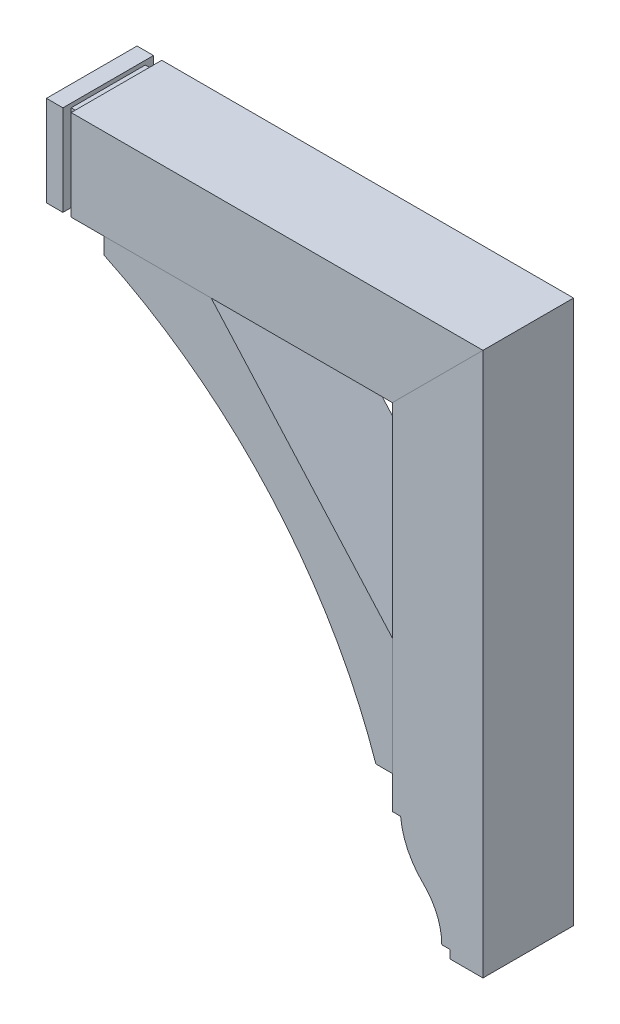
ISO-10303-21;
HEADER;
FILE_DESCRIPTION(('STEP AP214'),'2;1');
FILE_NAME('part.step','',(''),(''),'','','');
FILE_SCHEMA(('AUTOMOTIVE_DESIGN { 1 0 10303 214 1 1 1 1 }'));
ENDSEC;
DATA;
#1=APPLICATION_CONTEXT('core data for automotive mechanical design processes');
#2=APPLICATION_PROTOCOL_DEFINITION('international standard','automotive_design',2000,#1);
#3=PRODUCT_CONTEXT('',#1,'mechanical');
#4=PRODUCT('Part','Part','',(#3));
#5=PRODUCT_RELATED_PRODUCT_CATEGORY('part','',(#4));
#6=PRODUCT_DEFINITION_FORMATION('','',#4);
#7=PRODUCT_DEFINITION_CONTEXT('part definition',#1,'design');
#8=PRODUCT_DEFINITION('design','',#6,#7);
#9=PRODUCT_DEFINITION_SHAPE('','',#8);
#10=(LENGTH_UNIT() NAMED_UNIT(*) SI_UNIT(.MILLI.,.METRE.));
#11=(NAMED_UNIT(*) PLANE_ANGLE_UNIT() SI_UNIT($,.RADIAN.));
#12=(NAMED_UNIT(*) SI_UNIT($,.STERADIAN.) SOLID_ANGLE_UNIT());
#13=UNCERTAINTY_MEASURE_WITH_UNIT(LENGTH_MEASURE(1.E-05),#10,'distance_accuracy_value','');
#14=(GEOMETRIC_REPRESENTATION_CONTEXT(3) GLOBAL_UNCERTAINTY_ASSIGNED_CONTEXT((#13)) GLOBAL_UNIT_ASSIGNED_CONTEXT((#10,
#11,#12)) REPRESENTATION_CONTEXT('',''));
#15=CARTESIAN_POINT('',(0.,0.,0.));
#16=DIRECTION('',(0.,0.,1.));
#17=DIRECTION('',(1.,0.,0.));
#18=AXIS2_PLACEMENT_3D('',#15,#16,#17);
#19=CARTESIAN_POINT('',(0.,228.24431630972,69.85));
#20=DIRECTION('',(0.,1.,0.));
#21=DIRECTION('',(-1.,0.,0.));
#22=AXIS2_PLACEMENT_3D('',#19,#20,#21);
#23=PLANE('',#22);
#24=DIRECTION('',(1.,0.,0.));
#25=VECTOR('',#24,1.);
#26=CARTESIAN_POINT('',(0.,228.24431630972,-69.85));
#27=LINE('',#26,#25);
#28=CARTESIAN_POINT('',(-352.423927863135,228.24431630972,-69.85));
#29=VERTEX_POINT('',#28);
#30=CARTESIAN_POINT('',(142.876072136865,228.24431630972,-69.85));
#31=VERTEX_POINT('',#30);
#32=EDGE_CURVE('E131',#29,#31,#27,.T.);
#33=ORIENTED_EDGE('',*,*,#32,.T.);
#34=DIRECTION('',(0.,0.,-1.));
#35=VECTOR('',#34,1.);
#36=CARTESIAN_POINT('',(142.876072136865,228.24431630972,69.85));
#37=LINE('',#36,#35);
#38=CARTESIAN_POINT('',(142.876072136865,228.24431630972,69.85));
#39=VERTEX_POINT('',#38);
#40=EDGE_CURVE('E13',#39,#31,#37,.T.);
#41=ORIENTED_EDGE('',*,*,#40,.F.);
#42=DIRECTION('',(1.,0.,0.));
#43=VECTOR('',#42,1.);
#44=CARTESIAN_POINT('',(0.,228.24431630972,69.85));
#45=LINE('',#44,#43);
#46=CARTESIAN_POINT('',(-352.423927863135,228.24431630972,69.85));
#47=VERTEX_POINT('',#46);
#48=EDGE_CURVE('E114',#47,#39,#45,.T.);
#49=ORIENTED_EDGE('',*,*,#48,.F.);
#50=DIRECTION('',(0.,0.,-1.));
#51=VECTOR('',#50,1.);
#52=CARTESIAN_POINT('',(-352.423927863135,228.24431630972,69.85));
#53=LINE('',#52,#51);
#54=EDGE_CURVE('E127',#47,#29,#53,.T.);
#55=ORIENTED_EDGE('',*,*,#54,.T.);
#56=EDGE_LOOP('',(#33,#41,#49,#55));
#57=FACE_BOUND('',#56,.T.);
#58=ADVANCED_FACE('F62',(#57),#23,.F.);
#59=CARTESIAN_POINT('',(-42.6841220864275,42.6841220864275,69.85));
#60=DIRECTION('',(-0.707106781186548,0.707106781186547,0.));
#61=DIRECTION('',(-0.707106781186547,-0.707106781186548,0.));
#62=AXIS2_PLACEMENT_3D('',#59,#60,#61);
#63=PLANE('',#62);
#64=DIRECTION('',(0.707106781186547,0.707106781186548,0.));
#65=VECTOR('',#64,1.);
#66=CARTESIAN_POINT('',(-42.6841220864275,42.6841220864275,-69.85));
#67=LINE('',#66,#65);
#68=CARTESIAN_POINT('',(282.576072136865,367.94431630972,-69.85));
#69=VERTEX_POINT('',#68);
#70=EDGE_CURVE('E119',#31,#69,#67,.T.);
#71=ORIENTED_EDGE('',*,*,#70,.T.);
#72=DIRECTION('',(0.,0.,-1.));
#73=VECTOR('',#72,1.);
#74=CARTESIAN_POINT('',(282.576072136865,367.94431630972,69.85));
#75=LINE('',#74,#73);
#76=CARTESIAN_POINT('',(282.576072136865,367.94431630972,69.85));
#77=VERTEX_POINT('',#76);
#78=EDGE_CURVE('E71',#77,#69,#75,.T.);
#79=ORIENTED_EDGE('',*,*,#78,.F.);
#80=DIRECTION('',(0.707106781186547,0.707106781186548,0.));
#81=VECTOR('',#80,1.);
#82=CARTESIAN_POINT('',(-42.6841220864275,42.6841220864275,69.85));
#83=LINE('',#82,#81);
#84=EDGE_CURVE('E109',#39,#77,#83,.T.);
#85=ORIENTED_EDGE('',*,*,#84,.F.);
#86=ORIENTED_EDGE('',*,*,#40,.T.);
#87=EDGE_LOOP('',(#71,#79,#85,#86));
#88=FACE_BOUND('',#87,.T.);
#89=ADVANCED_FACE('F118',(#88),#63,.F.);
#90=CARTESIAN_POINT('',(0.,367.94431630972,69.85));
#91=DIRECTION('',(0.,-1.,0.));
#92=DIRECTION('',(1.,0.,0.));
#93=AXIS2_PLACEMENT_3D('',#90,#91,#92);
#94=PLANE('',#93);
#95=DIRECTION('',(-1.,0.,0.));
#96=VECTOR('',#95,1.);
#97=CARTESIAN_POINT('',(0.,367.94431630972,-69.85));
#98=LINE('',#97,#96);
#99=CARTESIAN_POINT('',(-352.423927863135,367.94431630972,-69.85));
#100=VERTEX_POINT('',#99);
#101=EDGE_CURVE('E96',#69,#100,#98,.T.);
#102=ORIENTED_EDGE('',*,*,#101,.T.);
#103=DIRECTION('',(0.,0.,-1.));
#104=VECTOR('',#103,1.);
#105=CARTESIAN_POINT('',(-352.423927863135,367.94431630972,69.85));
#106=LINE('',#105,#104);
#107=CARTESIAN_POINT('',(-352.423927863135,367.94431630972,69.85));
#108=VERTEX_POINT('',#107);
#109=EDGE_CURVE('E121',#108,#100,#106,.T.);
#110=ORIENTED_EDGE('',*,*,#109,.F.);
#111=DIRECTION('',(-1.,0.,0.));
#112=VECTOR('',#111,1.);
#113=CARTESIAN_POINT('',(0.,367.94431630972,69.85));
#114=LINE('',#113,#112);
#115=EDGE_CURVE('E112',#77,#108,#114,.T.);
#116=ORIENTED_EDGE('',*,*,#115,.F.);
#117=ORIENTED_EDGE('',*,*,#78,.T.);
#118=EDGE_LOOP('',(#102,#110,#116,#117));
#119=FACE_BOUND('',#118,.T.);
#120=ADVANCED_FACE('F122',(#119),#94,.F.);
#121=CARTESIAN_POINT('',(-352.423927863135,0.,69.85));
#122=DIRECTION('',(1.,0.,0.));
#123=DIRECTION('',(0.,0.,-1.));
#124=AXIS2_PLACEMENT_3D('',#121,#122,#123);
#125=PLANE('',#124);
#126=DIRECTION('',(0.,-1.,0.));
#127=VECTOR('',#126,1.);
#128=CARTESIAN_POINT('',(-352.423927863135,0.,-69.85));
#129=LINE('',#128,#127);
#130=EDGE_CURVE('E102',#100,#29,#129,.T.);
#131=ORIENTED_EDGE('',*,*,#130,.T.);
#132=ORIENTED_EDGE('',*,*,#54,.F.);
#133=DIRECTION('',(0.,-1.,0.));
#134=VECTOR('',#133,1.);
#135=CARTESIAN_POINT('',(-352.423927863135,0.,69.85));
#136=LINE('',#135,#134);
#137=EDGE_CURVE('E79',#108,#47,#136,.T.);
#138=ORIENTED_EDGE('',*,*,#137,.F.);
#139=ORIENTED_EDGE('',*,*,#109,.T.);
#140=EDGE_LOOP('',(#131,#132,#138,#139));
#141=FACE_BOUND('',#140,.T.);
#142=ADVANCED_FACE('F143',(#141),#125,.F.);
#143=CARTESIAN_POINT('',(0.,0.,69.85));
#144=DIRECTION('',(0.,0.,1.));
#145=DIRECTION('',(1.,0.,0.));
#146=AXIS2_PLACEMENT_3D('',#143,#144,#145);
#147=PLANE('',#146);
#148=ORIENTED_EDGE('',*,*,#48,.T.);
#149=ORIENTED_EDGE('',*,*,#84,.T.);
#150=ORIENTED_EDGE('',*,*,#115,.T.);
#151=ORIENTED_EDGE('',*,*,#137,.T.);
#152=EDGE_LOOP('',(#148,#149,#150,#151));
#153=FACE_BOUND('',#152,.T.);
#154=ADVANCED_FACE('F110',(#153),#147,.T.);
#155=CARTESIAN_POINT('',(0.,0.,-69.85));
#156=DIRECTION('',(0.,0.,1.));
#157=DIRECTION('',(1.,0.,0.));
#158=AXIS2_PLACEMENT_3D('',#155,#156,#157);
#159=PLANE('',#158);
#160=ORIENTED_EDGE('',*,*,#32,.F.);
#161=ORIENTED_EDGE('',*,*,#130,.F.);
#162=ORIENTED_EDGE('',*,*,#101,.F.);
#163=ORIENTED_EDGE('',*,*,#70,.F.);
#164=EDGE_LOOP('',(#160,#161,#162,#163));
#165=FACE_BOUND('',#164,.T.);
#166=ADVANCED_FACE('F146',(#165),#159,.F.);
#167=CLOSED_SHELL('',(#58,#89,#120,#142,#154,#166));
#168=MANIFOLD_SOLID_BREP('B2',#167);
#169=CARTESIAN_POINT('',(0.,361.59431630972,57.15));
#170=DIRECTION('',(0.,-1.,0.));
#171=DIRECTION('',(0.,0.,-1.));
#172=AXIS2_PLACEMENT_3D('',#169,#170,#171);
#173=PLANE('',#172);
#174=DIRECTION('',(-1.,0.,0.));
#175=VECTOR('',#174,1.);
#176=CARTESIAN_POINT('',(0.,361.59431630972,-57.15));
#177=LINE('',#176,#175);
#178=CARTESIAN_POINT('',(-352.423927863135,361.59431630972,-57.15));
#179=VERTEX_POINT('',#178);
#180=CARTESIAN_POINT('',(-365.123927863135,361.59431630972,-57.15));
#181=VERTEX_POINT('',#180);
#182=EDGE_CURVE('E357',#179,#181,#177,.T.);
#183=ORIENTED_EDGE('',*,*,#182,.T.);
#184=DIRECTION('',(0.,0.,-1.));
#185=VECTOR('',#184,1.);
#186=CARTESIAN_POINT('',(-365.123927863135,361.59431630972,57.15));
#187=LINE('',#186,#185);
#188=CARTESIAN_POINT('',(-365.123927863135,361.59431630972,57.15));
#189=VERTEX_POINT('',#188);
#190=EDGE_CURVE('E60',#189,#181,#187,.T.);
#191=ORIENTED_EDGE('',*,*,#190,.F.);
#192=DIRECTION('',(-1.,0.,0.));
#193=VECTOR('',#192,1.);
#194=CARTESIAN_POINT('',(0.,361.59431630972,57.15));
#195=LINE('',#194,#193);
#196=CARTESIAN_POINT('',(-352.423927863135,361.59431630972,57.15));
#197=VERTEX_POINT('',#196);
#198=EDGE_CURVE('E307',#197,#189,#195,.T.);
#199=ORIENTED_EDGE('',*,*,#198,.F.);
#200=DIRECTION('',(0.,0.,-1.));
#201=VECTOR('',#200,1.);
#202=CARTESIAN_POINT('',(-352.423927863135,361.59431630972,57.15));
#203=LINE('',#202,#201);
#204=EDGE_CURVE('E248',#197,#179,#203,.T.);
#205=ORIENTED_EDGE('',*,*,#204,.T.);
#206=EDGE_LOOP('',(#183,#191,#199,#205));
#207=FACE_BOUND('',#206,.T.);
#208=ADVANCED_FACE('F229',(#207),#173,.F.);
#209=CARTESIAN_POINT('',(0.,234.59431630972,57.15));
#210=DIRECTION('',(0.,-1.,0.));
#211=DIRECTION('',(0.,0.,-1.));
#212=AXIS2_PLACEMENT_3D('',#209,#210,#211);
#213=PLANE('',#212);
#214=DIRECTION('',(-1.,0.,0.));
#215=VECTOR('',#214,1.);
#216=CARTESIAN_POINT('',(0.,234.59431630972,-57.15));
#217=LINE('',#216,#215);
#218=CARTESIAN_POINT('',(-352.423927863135,234.59431630972,-57.15));
#219=VERTEX_POINT('',#218);
#220=CARTESIAN_POINT('',(-365.123927863135,234.59431630972,-57.15));
#221=VERTEX_POINT('',#220);
#222=EDGE_CURVE('E365',#219,#221,#217,.T.);
#223=ORIENTED_EDGE('',*,*,#222,.F.);
#224=DIRECTION('',(0.,0.,-1.));
#225=VECTOR('',#224,1.);
#226=CARTESIAN_POINT('',(-352.423927863135,234.59431630972,57.15));
#227=LINE('',#226,#225);
#228=CARTESIAN_POINT('',(-352.423927863135,234.59431630972,57.15));
#229=VERTEX_POINT('',#228);
#230=EDGE_CURVE('E317',#229,#219,#227,.T.);
#231=ORIENTED_EDGE('',*,*,#230,.F.);
#232=DIRECTION('',(-1.,0.,0.));
#233=VECTOR('',#232,1.);
#234=CARTESIAN_POINT('',(0.,234.59431630972,57.15));
#235=LINE('',#234,#233);
#236=CARTESIAN_POINT('',(-365.123927863135,234.59431630972,57.15));
#237=VERTEX_POINT('',#236);
#238=EDGE_CURVE('E306',#229,#237,#235,.T.);
#239=ORIENTED_EDGE('',*,*,#238,.T.);
#240=DIRECTION('',(0.,0.,-1.));
#241=VECTOR('',#240,1.);
#242=CARTESIAN_POINT('',(-365.123927863135,234.59431630972,57.15));
#243=LINE('',#242,#241);
#244=EDGE_CURVE('E239',#237,#221,#243,.T.);
#245=ORIENTED_EDGE('',*,*,#244,.T.);
#246=EDGE_LOOP('',(#223,#231,#239,#245));
#247=FACE_BOUND('',#246,.T.);
#248=ADVANCED_FACE('F315',(#247),#213,.T.);
#249=CARTESIAN_POINT('',(-352.423927863135,0.,57.15));
#250=DIRECTION('',(1.,0.,0.));
#251=DIRECTION('',(0.,0.,-1.));
#252=AXIS2_PLACEMENT_3D('',#249,#250,#251);
#253=PLANE('',#252);
#254=DIRECTION('',(0.,-1.,0.));
#255=VECTOR('',#254,1.);
#256=CARTESIAN_POINT('',(-352.423927863135,0.,-57.15));
#257=LINE('',#256,#255);
#258=EDGE_CURVE('E367',#179,#219,#257,.T.);
#259=ORIENTED_EDGE('',*,*,#258,.F.);
#260=ORIENTED_EDGE('',*,*,#204,.F.);
#261=DIRECTION('',(0.,-1.,0.));
#262=VECTOR('',#261,1.);
#263=CARTESIAN_POINT('',(-352.423927863135,0.,57.15));
#264=LINE('',#263,#262);
#265=EDGE_CURVE('E319',#197,#229,#264,.T.);
#266=ORIENTED_EDGE('',*,*,#265,.T.);
#267=ORIENTED_EDGE('',*,*,#230,.T.);
#268=EDGE_LOOP('',(#259,#260,#266,#267));
#269=FACE_BOUND('',#268,.T.);
#270=ADVANCED_FACE('F443',(#269),#253,.T.);
#271=CARTESIAN_POINT('',(0.,0.,57.15));
#272=DIRECTION('',(0.,0.,1.));
#273=DIRECTION('',(1.,0.,0.));
#274=AXIS2_PLACEMENT_3D('',#271,#272,#273);
#275=PLANE('',#274);
#276=ORIENTED_EDGE('',*,*,#198,.T.);
#277=DIRECTION('',(0.,-1.,0.));
#278=VECTOR('',#277,1.);
#279=CARTESIAN_POINT('',(-365.123927863135,0.,57.15));
#280=LINE('',#279,#278);
#281=EDGE_CURVE('E302',#189,#237,#280,.T.);
#282=ORIENTED_EDGE('',*,*,#281,.T.);
#283=ORIENTED_EDGE('',*,*,#238,.F.);
#284=ORIENTED_EDGE('',*,*,#265,.F.);
#285=EDGE_LOOP('',(#276,#282,#283,#284));
#286=FACE_BOUND('',#285,.T.);
#287=ADVANCED_FACE('F304',(#286),#275,.T.);
#288=CARTESIAN_POINT('',(0.,0.,-57.15));
#289=DIRECTION('',(0.,0.,1.));
#290=DIRECTION('',(1.,0.,0.));
#291=AXIS2_PLACEMENT_3D('',#288,#289,#290);
#292=PLANE('',#291);
#293=ORIENTED_EDGE('',*,*,#182,.F.);
#294=ORIENTED_EDGE('',*,*,#258,.T.);
#295=ORIENTED_EDGE('',*,*,#222,.T.);
#296=DIRECTION('',(0.,-1.,0.));
#297=VECTOR('',#296,1.);
#298=CARTESIAN_POINT('',(-365.123927863135,0.,-57.15));
#299=LINE('',#298,#297);
#300=EDGE_CURVE('E325',#181,#221,#299,.T.);
#301=ORIENTED_EDGE('',*,*,#300,.F.);
#302=EDGE_LOOP('',(#293,#294,#295,#301));
#303=FACE_BOUND('',#302,.T.);
#304=ADVANCED_FACE('F429',(#303),#292,.F.);
#305=CARTESIAN_POINT('',(0.,367.94431630972,69.85));
#306=DIRECTION('',(0.,-1.,0.));
#307=DIRECTION('',(0.,0.,-1.));
#308=AXIS2_PLACEMENT_3D('',#305,#306,#307);
#309=PLANE('',#308);
#310=DIRECTION('',(-1.,0.,0.));
#311=VECTOR('',#310,1.);
#312=CARTESIAN_POINT('',(0.,367.94431630972,-69.85));
#313=LINE('',#312,#311);
#314=CARTESIAN_POINT('',(-365.123927863135,367.94431630972,-69.85));
#315=VERTEX_POINT('',#314);
#316=CARTESIAN_POINT('',(-390.523927863135,367.94431630972,-69.85));
#317=VERTEX_POINT('',#316);
#318=EDGE_CURVE('E334',#315,#317,#313,.T.);
#319=ORIENTED_EDGE('',*,*,#318,.T.);
#320=DIRECTION('',(0.,0.,1.));
#321=VECTOR('',#320,1.);
#322=CARTESIAN_POINT('',(-390.523927863135,367.94431630972,0.));
#323=LINE('',#322,#321);
#324=CARTESIAN_POINT('',(-390.523927863135,367.94431630972,69.85));
#325=VERTEX_POINT('',#324);
#326=EDGE_CURVE('E354',#325,#317,#323,.F.);
#327=ORIENTED_EDGE('',*,*,#326,.F.);
#328=DIRECTION('',(-1.,0.,0.));
#329=VECTOR('',#328,1.);
#330=CARTESIAN_POINT('',(0.,367.94431630972,69.85));
#331=LINE('',#330,#329);
#332=CARTESIAN_POINT('',(-365.123927863135,367.94431630972,69.85));
#333=VERTEX_POINT('',#332);
#334=EDGE_CURVE('E339',#333,#325,#331,.T.);
#335=ORIENTED_EDGE('',*,*,#334,.F.);
#336=DIRECTION('',(0.,0.,-1.));
#337=VECTOR('',#336,1.);
#338=CARTESIAN_POINT('',(-365.123927863135,367.94431630972,69.85));
#339=LINE('',#338,#337);
#340=EDGE_CURVE('E362',#333,#315,#339,.T.);
#341=ORIENTED_EDGE('',*,*,#340,.T.);
#342=EDGE_LOOP('',(#319,#327,#335,#341));
#343=FACE_BOUND('',#342,.T.);
#344=ADVANCED_FACE('F427',(#343),#309,.F.);
#345=CARTESIAN_POINT('',(0.,228.24431630972,69.85));
#346=DIRECTION('',(0.,-1.,0.));
#347=DIRECTION('',(0.,0.,-1.));
#348=AXIS2_PLACEMENT_3D('',#345,#346,#347);
#349=PLANE('',#348);
#350=DIRECTION('',(-1.,0.,0.));
#351=VECTOR('',#350,1.);
#352=CARTESIAN_POINT('',(0.,228.24431630972,-69.85));
#353=LINE('',#352,#351);
#354=CARTESIAN_POINT('',(-365.123927863135,228.24431630972,-69.85));
#355=VERTEX_POINT('',#354);
#356=CARTESIAN_POINT('',(-390.523927863135,228.24431630972,-69.85));
#357=VERTEX_POINT('',#356);
#358=EDGE_CURVE('E347',#355,#357,#353,.T.);
#359=ORIENTED_EDGE('',*,*,#358,.F.);
#360=DIRECTION('',(0.,0.,-1.));
#361=VECTOR('',#360,1.);
#362=CARTESIAN_POINT('',(-365.123927863135,228.24431630972,69.85));
#363=LINE('',#362,#361);
#364=CARTESIAN_POINT('',(-365.123927863135,228.24431630972,69.85));
#365=VERTEX_POINT('',#364);
#366=EDGE_CURVE('E286',#365,#355,#363,.T.);
#367=ORIENTED_EDGE('',*,*,#366,.F.);
#368=DIRECTION('',(-1.,0.,0.));
#369=VECTOR('',#368,1.);
#370=CARTESIAN_POINT('',(0.,228.24431630972,69.85));
#371=LINE('',#370,#369);
#372=CARTESIAN_POINT('',(-390.523927863135,228.24431630972,69.85));
#373=VERTEX_POINT('',#372);
#374=EDGE_CURVE('E343',#365,#373,#371,.T.);
#375=ORIENTED_EDGE('',*,*,#374,.T.);
#376=DIRECTION('',(0.,0.,-1.));
#377=VECTOR('',#376,1.);
#378=CARTESIAN_POINT('',(-390.523927863135,228.24431630972,69.85));
#379=LINE('',#378,#377);
#380=EDGE_CURVE('E232',#373,#357,#379,.T.);
#381=ORIENTED_EDGE('',*,*,#380,.T.);
#382=EDGE_LOOP('',(#359,#367,#375,#381));
#383=FACE_BOUND('',#382,.T.);
#384=ADVANCED_FACE('F418',(#383),#349,.T.);
#385=CARTESIAN_POINT('',(-365.123927863135,0.,69.85));
#386=DIRECTION('',(1.,0.,0.));
#387=DIRECTION('',(0.,0.,-1.));
#388=AXIS2_PLACEMENT_3D('',#385,#386,#387);
#389=PLANE('',#388);
#390=ORIENTED_EDGE('',*,*,#190,.T.);
#391=ORIENTED_EDGE('',*,*,#300,.T.);
#392=ORIENTED_EDGE('',*,*,#244,.F.);
#393=ORIENTED_EDGE('',*,*,#281,.F.);
#394=EDGE_LOOP('',(#390,#391,#392,#393));
#395=FACE_BOUND('',#394,.T.);
#396=DIRECTION('',(0.,-1.,0.));
#397=VECTOR('',#396,1.);
#398=CARTESIAN_POINT('',(-365.123927863135,0.,-69.85));
#399=LINE('',#398,#397);
#400=EDGE_CURVE('E342',#315,#355,#399,.T.);
#401=ORIENTED_EDGE('',*,*,#400,.F.);
#402=ORIENTED_EDGE('',*,*,#340,.F.);
#403=DIRECTION('',(0.,-1.,0.));
#404=VECTOR('',#403,1.);
#405=CARTESIAN_POINT('',(-365.123927863135,0.,69.85));
#406=LINE('',#405,#404);
#407=EDGE_CURVE('E346',#333,#365,#406,.T.);
#408=ORIENTED_EDGE('',*,*,#407,.T.);
#409=ORIENTED_EDGE('',*,*,#366,.T.);
#410=EDGE_LOOP('',(#401,#402,#408,#409));
#411=FACE_BOUND('',#410,.T.);
#412=ADVANCED_FACE('F322',(#395,#411),#389,.T.);
#413=CARTESIAN_POINT('',(0.,0.,69.85));
#414=DIRECTION('',(0.,0.,1.));
#415=DIRECTION('',(1.,0.,0.));
#416=AXIS2_PLACEMENT_3D('',#413,#414,#415);
#417=PLANE('',#416);
#418=ORIENTED_EDGE('',*,*,#334,.T.);
#419=DIRECTION('',(0.,1.,0.));
#420=VECTOR('',#419,1.);
#421=CARTESIAN_POINT('',(-390.523927863135,0.,69.85));
#422=LINE('',#421,#420);
#423=EDGE_CURVE('E278',#325,#373,#422,.F.);
#424=ORIENTED_EDGE('',*,*,#423,.T.);
#425=ORIENTED_EDGE('',*,*,#374,.F.);
#426=ORIENTED_EDGE('',*,*,#407,.F.);
#427=EDGE_LOOP('',(#418,#424,#425,#426));
#428=FACE_BOUND('',#427,.T.);
#429=ADVANCED_FACE('F425',(#428),#417,.T.);
#430=CARTESIAN_POINT('',(0.,0.,-69.85));
#431=DIRECTION('',(0.,0.,1.));
#432=DIRECTION('',(1.,0.,0.));
#433=AXIS2_PLACEMENT_3D('',#430,#431,#432);
#434=PLANE('',#433);
#435=ORIENTED_EDGE('',*,*,#318,.F.);
#436=ORIENTED_EDGE('',*,*,#400,.T.);
#437=ORIENTED_EDGE('',*,*,#358,.T.);
#438=DIRECTION('',(0.,1.,0.));
#439=VECTOR('',#438,1.);
#440=CARTESIAN_POINT('',(-390.523927863135,0.,-69.85));
#441=LINE('',#440,#439);
#442=EDGE_CURVE('E337',#317,#357,#441,.F.);
#443=ORIENTED_EDGE('',*,*,#442,.F.);
#444=EDGE_LOOP('',(#435,#436,#437,#443));
#445=FACE_BOUND('',#444,.T.);
#446=ADVANCED_FACE('F421',(#445),#434,.F.);
#447=CARTESIAN_POINT('',(-455.65426845784,248.538691886095,0.));
#448=DIRECTION('',(0.877895572914384,-0.478852130680573,0.));
#449=DIRECTION('',(0.478852130680573,0.877895572914384,0.));
#450=AXIS2_PLACEMENT_3D('',#447,#448,#449);
#451=PLANE('',#450);
#452=DIRECTION('',(-0.35985608634244,-0.659736158294474,0.659736158294474));
#453=VECTOR('',#452,1.);
#454=CARTESIAN_POINT('',(-390.523927863135,367.94431630972,-69.85));
#455=LINE('',#454,#453);
#456=CARTESIAN_POINT('',(-428.623927863135,298.09431630972,0.));
#457=VERTEX_POINT('',#456);
#458=EDGE_CURVE('E397',#317,#457,#455,.T.);
#459=ORIENTED_EDGE('',*,*,#458,.T.);
#460=DIRECTION('',(-0.35985608634244,-0.659736158294474,-0.659736158294474));
#461=VECTOR('',#460,1.);
#462=CARTESIAN_POINT('',(-390.523927863135,367.94431630972,69.85));
#463=LINE('',#462,#461);
#464=EDGE_CURVE('E396',#325,#457,#463,.T.);
#465=ORIENTED_EDGE('',*,*,#464,.F.);
#466=ORIENTED_EDGE('',*,*,#326,.T.);
#467=EDGE_LOOP('',(#459,#465,#466));
#468=FACE_BOUND('',#467,.T.);
#469=ADVANCED_FACE('F407',(#468),#451,.F.);
#470=CARTESIAN_POINT('',(-330.34073421299,0.,180.185855025267));
#471=DIRECTION('',(0.877895572914384,0.,-0.478852130680573));
#472=DIRECTION('',(-0.478852130680573,0.,-0.877895572914384));
#473=AXIS2_PLACEMENT_3D('',#470,#471,#472);
#474=PLANE('',#473);
#475=ORIENTED_EDGE('',*,*,#464,.T.);
#476=DIRECTION('',(-0.359856086342441,0.659736158294474,-0.659736158294474));
#477=VECTOR('',#476,1.);
#478=CARTESIAN_POINT('',(-390.523927863135,228.24431630972,69.85));
#479=LINE('',#478,#477);
#480=EDGE_CURVE('E338',#373,#457,#479,.T.);
#481=ORIENTED_EDGE('',*,*,#480,.F.);
#482=ORIENTED_EDGE('',*,*,#423,.F.);
#483=EDGE_LOOP('',(#475,#481,#482));
#484=FACE_BOUND('',#483,.T.);
#485=ADVANCED_FACE('F404',(#484),#474,.F.);
#486=CARTESIAN_POINT('',(-330.34073421299,0.,-180.185855025267));
#487=DIRECTION('',(0.877895572914384,0.,0.478852130680573));
#488=DIRECTION('',(0.478852130680573,0.,-0.877895572914384));
#489=AXIS2_PLACEMENT_3D('',#486,#487,#488);
#490=PLANE('',#489);
#491=DIRECTION('',(-0.359856086342441,0.659736158294474,0.659736158294474));
#492=VECTOR('',#491,1.);
#493=CARTESIAN_POINT('',(-390.523927863135,228.24431630972,-69.85));
#494=LINE('',#493,#492);
#495=EDGE_CURVE('E393',#357,#457,#494,.T.);
#496=ORIENTED_EDGE('',*,*,#495,.T.);
#497=ORIENTED_EDGE('',*,*,#458,.F.);
#498=ORIENTED_EDGE('',*,*,#442,.T.);
#499=EDGE_LOOP('',(#496,#497,#498));
#500=FACE_BOUND('',#499,.T.);
#501=ADVANCED_FACE('F411',(#500),#490,.F.);
#502=CARTESIAN_POINT('',(-205.027199968139,-111.83301816444,0.));
#503=DIRECTION('',(0.877895572914384,0.478852130680574,0.));
#504=DIRECTION('',(-0.478852130680574,0.877895572914384,0.));
#505=AXIS2_PLACEMENT_3D('',#502,#503,#504);
#506=PLANE('',#505);
#507=ORIENTED_EDGE('',*,*,#480,.T.);
#508=ORIENTED_EDGE('',*,*,#495,.F.);
#509=ORIENTED_EDGE('',*,*,#380,.F.);
#510=EDGE_LOOP('',(#507,#508,#509));
#511=FACE_BOUND('',#510,.T.);
#512=ADVANCED_FACE('F415',(#511),#506,.F.);
#513=CLOSED_SHELL('',(#208,#248,#270,#287,#304,#344,#384,#412,#429,#446,#469,#485,#501,#512));
#514=MANIFOLD_SOLID_BREP('B7',#513);
#515=CARTESIAN_POINT('',(-651.313256281985,-530.886706334119,69.85));
#516=DIRECTION('',(0.,0.,-1.));
#517=DIRECTION('',(-1.,0.,0.));
#518=AXIS2_PLACEMENT_3D('',#515,#516,#517);
#519=CYLINDRICAL_SURFACE('',#518,812.8);
#520=CARTESIAN_POINT('',(-651.313256281985,-530.886706334119,-69.85));
#521=DIRECTION('',(0.,0.,1.));
#522=DIRECTION('',(1.,0.,0.));
#523=AXIS2_PLACEMENT_3D('',#520,#521,#522);
#524=CIRCLE('',#523,812.8);
#525=CARTESIAN_POINT('',(-301.623927863135,202.84431630972,-69.85));
#526=VERTEX_POINT('',#525);
#527=CARTESIAN_POINT('',(117.476072136865,-267.05568369028,-69.85));
#528=VERTEX_POINT('',#527);
#529=EDGE_CURVE('E675',#526,#528,#524,.F.);
#530=ORIENTED_EDGE('',*,*,#529,.T.);
#531=DIRECTION('',(0.,0.,-1.));
#532=VECTOR('',#531,1.);
#533=CARTESIAN_POINT('',(117.476072136865,-267.05568369028,69.85));
#534=LINE('',#533,#532);
#535=CARTESIAN_POINT('',(117.476072136865,-267.05568369028,69.85));
#536=VERTEX_POINT('',#535);
#537=EDGE_CURVE('E227',#536,#528,#534,.T.);
#538=ORIENTED_EDGE('',*,*,#537,.F.);
#539=CARTESIAN_POINT('',(-651.313256281985,-530.886706334119,69.85));
#540=DIRECTION('',(0.,0.,1.));
#541=DIRECTION('',(1.,0.,0.));
#542=AXIS2_PLACEMENT_3D('',#539,#540,#541);
#543=CIRCLE('',#542,812.8);
#544=CARTESIAN_POINT('',(-301.623927863135,202.84431630972,69.85));
#545=VERTEX_POINT('',#544);
#546=EDGE_CURVE('E634',#545,#536,#543,.F.);
#547=ORIENTED_EDGE('',*,*,#546,.F.);
#548=DIRECTION('',(0.,0.,-1.));
#549=VECTOR('',#548,1.);
#550=CARTESIAN_POINT('',(-301.623927863135,202.84431630972,69.85));
#551=LINE('',#550,#549);
#552=EDGE_CURVE('E671',#545,#526,#551,.T.);
#553=ORIENTED_EDGE('',*,*,#552,.T.);
#554=EDGE_LOOP('',(#530,#538,#547,#553));
#555=FACE_BOUND('',#554,.T.);
#556=ADVANCED_FACE('F587',(#555),#519,.F.);
#557=CARTESIAN_POINT('',(0.,-267.05568369028,69.85));
#558=DIRECTION('',(0.,-1.,0.));
#559=DIRECTION('',(0.,0.,-1.));
#560=AXIS2_PLACEMENT_3D('',#557,#558,#559);
#561=PLANE('',#560);
#562=DIRECTION('',(-1.,0.,0.));
#563=VECTOR('',#562,1.);
#564=CARTESIAN_POINT('',(0.,-267.05568369028,-69.85));
#565=LINE('',#564,#563);
#566=CARTESIAN_POINT('',(142.876072136865,-267.05568369028,-69.85));
#567=VERTEX_POINT('',#566);
#568=EDGE_CURVE('E679',#567,#528,#565,.T.);
#569=ORIENTED_EDGE('',*,*,#568,.F.);
#570=DIRECTION('',(0.,0.,-1.));
#571=VECTOR('',#570,1.);
#572=CARTESIAN_POINT('',(142.876072136865,-267.05568369028,69.85));
#573=LINE('',#572,#571);
#574=CARTESIAN_POINT('',(142.876072136865,-267.05568369028,69.85));
#575=VERTEX_POINT('',#574);
#576=EDGE_CURVE('E596',#575,#567,#573,.T.);
#577=ORIENTED_EDGE('',*,*,#576,.F.);
#578=DIRECTION('',(-1.,0.,0.));
#579=VECTOR('',#578,1.);
#580=CARTESIAN_POINT('',(0.,-267.05568369028,69.85));
#581=LINE('',#580,#579);
#582=EDGE_CURVE('E796',#575,#536,#581,.T.);
#583=ORIENTED_EDGE('',*,*,#582,.T.);
#584=ORIENTED_EDGE('',*,*,#537,.T.);
#585=EDGE_LOOP('',(#569,#577,#583,#584));
#586=FACE_BOUND('',#585,.T.);
#587=ADVANCED_FACE('F705',(#586),#561,.T.);
#588=CARTESIAN_POINT('',(142.876072136865,0.,69.85));
#589=DIRECTION('',(1.,0.,0.));
#590=DIRECTION('',(0.,1.,0.));
#591=AXIS2_PLACEMENT_3D('',#588,#589,#590);
#592=PLANE('',#591);
#593=DIRECTION('',(0.,-1.,0.));
#594=VECTOR('',#593,1.);
#595=CARTESIAN_POINT('',(142.876072136865,0.,-69.85));
#596=LINE('',#595,#594);
#597=CARTESIAN_POINT('',(142.876072136865,-86.0806836902802,-69.85));
#598=VERTEX_POINT('',#597);
#599=EDGE_CURVE('E683',#598,#567,#596,.T.);
#600=ORIENTED_EDGE('',*,*,#599,.F.);
#601=DIRECTION('',(0.,0.,-1.));
#602=VECTOR('',#601,1.);
#603=CARTESIAN_POINT('',(142.876072136865,-86.0806836902802,69.85));
#604=LINE('',#603,#602);
#605=CARTESIAN_POINT('',(142.876072136865,-86.0806836902802,69.85));
#606=VERTEX_POINT('',#605);
#607=EDGE_CURVE('E656',#606,#598,#604,.T.);
#608=ORIENTED_EDGE('',*,*,#607,.F.);
#609=DIRECTION('',(0.,-1.,0.));
#610=VECTOR('',#609,1.);
#611=CARTESIAN_POINT('',(142.876072136865,0.,69.85));
#612=LINE('',#611,#610);
#613=EDGE_CURVE('E662',#606,#575,#612,.T.);
#614=ORIENTED_EDGE('',*,*,#613,.T.);
#615=ORIENTED_EDGE('',*,*,#576,.T.);
#616=EDGE_LOOP('',(#600,#608,#614,#615));
#617=FACE_BOUND('',#616,.T.);
#618=ADVANCED_FACE('F702',(#617),#592,.T.);
#619=CARTESIAN_POINT('',(37.070018050937,32.9511271563885,69.85));
#620=DIRECTION('',(0.74740931868366,0.66436383882992,0.));
#621=DIRECTION('',(-0.66436383882992,0.74740931868366,0.));
#622=AXIS2_PLACEMENT_3D('',#619,#620,#621);
#623=PLANE('',#622);
#624=DIRECTION('',(0.66436383882992,-0.74740931868366,0.));
#625=VECTOR('',#624,1.);
#626=CARTESIAN_POINT('',(37.070018050937,32.9511271563885,-69.85));
#627=LINE('',#626,#625);
#628=CARTESIAN_POINT('',(-136.523927863135,228.24431630972,-69.85));
#629=VERTEX_POINT('',#628);
#630=EDGE_CURVE('E650',#629,#598,#627,.T.);
#631=ORIENTED_EDGE('',*,*,#630,.F.);
#632=DIRECTION('',(0.,0.,-1.));
#633=VECTOR('',#632,1.);
#634=CARTESIAN_POINT('',(-136.523927863135,228.24431630972,69.85));
#635=LINE('',#634,#633);
#636=CARTESIAN_POINT('',(-136.523927863135,228.24431630972,69.85));
#637=VERTEX_POINT('',#636);
#638=EDGE_CURVE('E645',#637,#629,#635,.T.);
#639=ORIENTED_EDGE('',*,*,#638,.F.);
#640=DIRECTION('',(0.66436383882992,-0.74740931868366,0.));
#641=VECTOR('',#640,1.);
#642=CARTESIAN_POINT('',(37.070018050937,32.9511271563885,69.85));
#643=LINE('',#642,#641);
#644=EDGE_CURVE('E648',#637,#606,#643,.T.);
#645=ORIENTED_EDGE('',*,*,#644,.T.);
#646=ORIENTED_EDGE('',*,*,#607,.T.);
#647=EDGE_LOOP('',(#631,#639,#645,#646));
#648=FACE_BOUND('',#647,.T.);
#649=ADVANCED_FACE('F647',(#648),#623,.T.);
#650=CARTESIAN_POINT('',(0.,228.24431630972,69.85));
#651=DIRECTION('',(0.,1.,0.));
#652=DIRECTION('',(-1.,0.,0.));
#653=AXIS2_PLACEMENT_3D('',#650,#651,#652);
#654=PLANE('',#653);
#655=DIRECTION('',(1.,0.,0.));
#656=VECTOR('',#655,1.);
#657=CARTESIAN_POINT('',(0.,228.24431630972,-69.85));
#658=LINE('',#657,#656);
#659=CARTESIAN_POINT('',(-301.623927863135,228.24431630972,-69.85));
#660=VERTEX_POINT('',#659);
#661=EDGE_CURVE('E688',#660,#629,#658,.T.);
#662=ORIENTED_EDGE('',*,*,#661,.F.);
#663=DIRECTION('',(0.,0.,-1.));
#664=VECTOR('',#663,1.);
#665=CARTESIAN_POINT('',(-301.623927863135,228.24431630972,69.85));
#666=LINE('',#665,#664);
#667=CARTESIAN_POINT('',(-301.623927863135,228.24431630972,69.85));
#668=VERTEX_POINT('',#667);
#669=EDGE_CURVE('E625',#668,#660,#666,.T.);
#670=ORIENTED_EDGE('',*,*,#669,.F.);
#671=DIRECTION('',(1.,0.,0.));
#672=VECTOR('',#671,1.);
#673=CARTESIAN_POINT('',(0.,228.24431630972,69.85));
#674=LINE('',#673,#672);
#675=EDGE_CURVE('E660',#668,#637,#674,.T.);
#676=ORIENTED_EDGE('',*,*,#675,.T.);
#677=ORIENTED_EDGE('',*,*,#638,.T.);
#678=EDGE_LOOP('',(#662,#670,#676,#677));
#679=FACE_BOUND('',#678,.T.);
#680=ADVANCED_FACE('F665',(#679),#654,.T.);
#681=CARTESIAN_POINT('',(-301.623927863135,0.,69.85));
#682=DIRECTION('',(1.,0.,0.));
#683=DIRECTION('',(0.,0.,-1.));
#684=AXIS2_PLACEMENT_3D('',#681,#682,#683);
#685=PLANE('',#684);
#686=DIRECTION('',(0.,-1.,0.));
#687=VECTOR('',#686,1.);
#688=CARTESIAN_POINT('',(-301.623927863135,0.,-69.85));
#689=LINE('',#688,#687);
#690=EDGE_CURVE('E628',#660,#526,#689,.T.);
#691=ORIENTED_EDGE('',*,*,#690,.T.);
#692=ORIENTED_EDGE('',*,*,#552,.F.);
#693=DIRECTION('',(0.,-1.,0.));
#694=VECTOR('',#693,1.);
#695=CARTESIAN_POINT('',(-301.623927863135,0.,69.85));
#696=LINE('',#695,#694);
#697=EDGE_CURVE('E604',#668,#545,#696,.T.);
#698=ORIENTED_EDGE('',*,*,#697,.F.);
#699=ORIENTED_EDGE('',*,*,#669,.T.);
#700=EDGE_LOOP('',(#691,#692,#698,#699));
#701=FACE_BOUND('',#700,.T.);
#702=ADVANCED_FACE('F710',(#701),#685,.F.);
#703=CARTESIAN_POINT('',(0.,0.,69.85));
#704=DIRECTION('',(0.,0.,1.));
#705=DIRECTION('',(1.,0.,0.));
#706=AXIS2_PLACEMENT_3D('',#703,#704,#705);
#707=PLANE('',#706);
#708=ORIENTED_EDGE('',*,*,#546,.T.);
#709=ORIENTED_EDGE('',*,*,#582,.F.);
#710=ORIENTED_EDGE('',*,*,#613,.F.);
#711=ORIENTED_EDGE('',*,*,#644,.F.);
#712=ORIENTED_EDGE('',*,*,#675,.F.);
#713=ORIENTED_EDGE('',*,*,#697,.T.);
#714=EDGE_LOOP('',(#708,#709,#710,#711,#712,#713));
#715=FACE_BOUND('',#714,.T.);
#716=ADVANCED_FACE('F659',(#715),#707,.T.);
#717=CARTESIAN_POINT('',(0.,0.,-69.85));
#718=DIRECTION('',(0.,0.,1.));
#719=DIRECTION('',(1.,0.,0.));
#720=AXIS2_PLACEMENT_3D('',#717,#718,#719);
#721=PLANE('',#720);
#722=ORIENTED_EDGE('',*,*,#529,.F.);
#723=ORIENTED_EDGE('',*,*,#690,.F.);
#724=ORIENTED_EDGE('',*,*,#661,.T.);
#725=ORIENTED_EDGE('',*,*,#630,.T.);
#726=ORIENTED_EDGE('',*,*,#599,.T.);
#727=ORIENTED_EDGE('',*,*,#568,.T.);
#728=EDGE_LOOP('',(#722,#723,#724,#725,#726,#727));
#729=FACE_BOUND('',#728,.T.);
#730=ADVANCED_FACE('F708',(#729),#721,.F.);
#731=CLOSED_SHELL('',(#556,#587,#618,#649,#680,#702,#716,#730));
#732=MANIFOLD_SOLID_BREP('B54',#731);
#733=CARTESIAN_POINT('',(270.932401521027,-306.772817307315,69.85));
#734=DIRECTION('',(0.,0.,-1.));
#735=DIRECTION('',(-1.,0.,0.));
#736=AXIS2_PLACEMENT_3D('',#733,#734,#735);
#737=CYLINDRICAL_SURFACE('',#736,115.8875);
#738=CARTESIAN_POINT('',(270.932401521027,-306.772817307315,-69.85));
#739=DIRECTION('',(0.,0.,1.));
#740=DIRECTION('',(1.,0.,0.));
#741=AXIS2_PLACEMENT_3D('',#738,#739,#740);
#742=CIRCLE('',#741,115.8875);
#743=CARTESIAN_POINT('',(155.576072136865,-317.85568369028,-69.85));
#744=VERTEX_POINT('',#743);
#745=CARTESIAN_POINT('',(190.456079210089,-390.160311594864,-69.85));
#746=VERTEX_POINT('',#745);
#747=EDGE_CURVE('E915',#744,#746,#742,.T.);
#748=ORIENTED_EDGE('',*,*,#747,.T.);
#749=DIRECTION('',(0.,0.,-1.));
#750=VECTOR('',#749,1.);
#751=CARTESIAN_POINT('',(190.456079210089,-390.160311594864,69.85));
#752=LINE('',#751,#750);
#753=CARTESIAN_POINT('',(190.456079210089,-390.160311594864,69.85));
#754=VERTEX_POINT('',#753);
#755=EDGE_CURVE('E585',#754,#746,#752,.T.);
#756=ORIENTED_EDGE('',*,*,#755,.F.);
#757=CARTESIAN_POINT('',(270.932401521027,-306.772817307315,69.85));
#758=DIRECTION('',(0.,0.,1.));
#759=DIRECTION('',(1.,0.,0.));
#760=AXIS2_PLACEMENT_3D('',#757,#758,#759);
#761=CIRCLE('',#760,115.8875);
#762=CARTESIAN_POINT('',(155.576072136865,-317.85568369028,69.85));
#763=VERTEX_POINT('',#762);
#764=EDGE_CURVE('E944',#763,#754,#761,.T.);
#765=ORIENTED_EDGE('',*,*,#764,.F.);
#766=DIRECTION('',(0.,0.,-1.));
#767=VECTOR('',#766,1.);
#768=CARTESIAN_POINT('',(155.576072136865,-317.85568369028,69.85));
#769=LINE('',#768,#767);
#770=EDGE_CURVE('E914',#763,#744,#769,.T.);
#771=ORIENTED_EDGE('',*,*,#770,.T.);
#772=EDGE_LOOP('',(#748,#756,#765,#771));
#773=FACE_BOUND('',#772,.T.);
#774=ADVANCED_FACE('F803',(#773),#737,.T.);
#775=CARTESIAN_POINT('',(125.413572136865,-457.55568369028,69.85));
#776=DIRECTION('',(0.,0.,-1.));
#777=DIRECTION('',(-1.,0.,0.));
#778=AXIS2_PLACEMENT_3D('',#775,#776,#777);
#779=CYLINDRICAL_SURFACE('',#778,93.6624999999999);
#780=CARTESIAN_POINT('',(125.413572136865,-457.55568369028,-69.85));
#781=DIRECTION('',(0.,0.,1.));
#782=DIRECTION('',(1.,0.,0.));
#783=AXIS2_PLACEMENT_3D('',#780,#781,#782);
#784=CIRCLE('',#783,93.6624999999999);
#785=CARTESIAN_POINT('',(219.076072136865,-457.55568369028,-69.85));
#786=VERTEX_POINT('',#785);
#787=EDGE_CURVE('E919',#746,#786,#784,.F.);
#788=ORIENTED_EDGE('',*,*,#787,.T.);
#789=DIRECTION('',(0.,0.,-1.));
#790=VECTOR('',#789,1.);
#791=CARTESIAN_POINT('',(219.076072136865,-457.55568369028,69.85));
#792=LINE('',#791,#790);
#793=CARTESIAN_POINT('',(219.076072136865,-457.55568369028,69.85));
#794=VERTEX_POINT('',#793);
#795=EDGE_CURVE('E812',#794,#786,#792,.T.);
#796=ORIENTED_EDGE('',*,*,#795,.F.);
#797=CARTESIAN_POINT('',(125.413572136865,-457.55568369028,69.85));
#798=DIRECTION('',(0.,0.,1.));
#799=DIRECTION('',(1.,0.,0.));
#800=AXIS2_PLACEMENT_3D('',#797,#798,#799);
#801=CIRCLE('',#800,93.6624999999999);
#802=EDGE_CURVE('E865',#754,#794,#801,.F.);
#803=ORIENTED_EDGE('',*,*,#802,.F.);
#804=ORIENTED_EDGE('',*,*,#755,.T.);
#805=EDGE_LOOP('',(#788,#796,#803,#804));
#806=FACE_BOUND('',#805,.T.);
#807=ADVANCED_FACE('F969',(#806),#779,.F.);
#808=CARTESIAN_POINT('',(-1.99995612236635E-12,-457.555683690279,69.85));
#809=DIRECTION('',(0.,-1.,0.));
#810=DIRECTION('',(1.,0.,0.));
#811=AXIS2_PLACEMENT_3D('',#808,#809,#810);
#812=PLANE('',#811);
#813=DIRECTION('',(-1.,0.,0.));
#814=VECTOR('',#813,1.);
#815=CARTESIAN_POINT('',(-1.99995612236635E-12,-457.555683690279,-69.85));
#816=LINE('',#815,#814);
#817=CARTESIAN_POINT('',(231.776072136865,-457.55568369028,-69.85));
#818=VERTEX_POINT('',#817);
#819=EDGE_CURVE('E923',#818,#786,#816,.T.);
#820=ORIENTED_EDGE('',*,*,#819,.F.);
#821=DIRECTION('',(0.,0.,-1.));
#822=VECTOR('',#821,1.);
#823=CARTESIAN_POINT('',(231.776072136865,-457.55568369028,69.85));
#824=LINE('',#823,#822);
#825=CARTESIAN_POINT('',(231.776072136865,-457.55568369028,69.85));
#826=VERTEX_POINT('',#825);
#827=EDGE_CURVE('E958',#826,#818,#824,.T.);
#828=ORIENTED_EDGE('',*,*,#827,.F.);
#829=DIRECTION('',(-1.,0.,0.));
#830=VECTOR('',#829,1.);
#831=CARTESIAN_POINT('',(-1.99995612236635E-12,-457.555683690279,69.85));
#832=LINE('',#831,#830);
#833=EDGE_CURVE('E968',#826,#794,#832,.T.);
#834=ORIENTED_EDGE('',*,*,#833,.T.);
#835=ORIENTED_EDGE('',*,*,#795,.T.);
#836=EDGE_LOOP('',(#820,#828,#834,#835));
#837=FACE_BOUND('',#836,.T.);
#838=ADVANCED_FACE('F966',(#837),#812,.T.);
#839=CARTESIAN_POINT('',(231.776072136865,0.,69.85));
#840=DIRECTION('',(-1.,0.,0.));
#841=DIRECTION('',(0.,0.,1.));
#842=AXIS2_PLACEMENT_3D('',#839,#840,#841);
#843=PLANE('',#842);
#844=DIRECTION('',(0.,1.,0.));
#845=VECTOR('',#844,1.);
#846=CARTESIAN_POINT('',(231.776072136865,0.,-69.85));
#847=LINE('',#846,#845);
#848=CARTESIAN_POINT('',(231.776072136865,-470.25568369028,-69.85));
#849=VERTEX_POINT('',#848);
#850=EDGE_CURVE('E927',#849,#818,#847,.T.);
#851=ORIENTED_EDGE('',*,*,#850,.F.);
#852=DIRECTION('',(0.,0.,-1.));
#853=VECTOR('',#852,1.);
#854=CARTESIAN_POINT('',(231.776072136865,-470.25568369028,69.85));
#855=LINE('',#854,#853);
#856=CARTESIAN_POINT('',(231.776072136865,-470.25568369028,69.85));
#857=VERTEX_POINT('',#856);
#858=EDGE_CURVE('E955',#857,#849,#855,.T.);
#859=ORIENTED_EDGE('',*,*,#858,.F.);
#860=DIRECTION('',(0.,1.,0.));
#861=VECTOR('',#860,1.);
#862=CARTESIAN_POINT('',(231.776072136865,0.,69.85));
#863=LINE('',#862,#861);
#864=EDGE_CURVE('E982',#857,#826,#863,.T.);
#865=ORIENTED_EDGE('',*,*,#864,.T.);
#866=ORIENTED_EDGE('',*,*,#827,.T.);
#867=EDGE_LOOP('',(#851,#859,#865,#866));
#868=FACE_BOUND('',#867,.T.);
#869=ADVANCED_FACE('F978',(#868),#843,.T.);
#870=CARTESIAN_POINT('',(5.13866818399404E-13,-470.25568369028,69.85));
#871=DIRECTION('',(0.,1.,0.));
#872=DIRECTION('',(-1.,0.,0.));
#873=AXIS2_PLACEMENT_3D('',#870,#871,#872);
#874=PLANE('',#873);
#875=DIRECTION('',(1.,0.,0.));
#876=VECTOR('',#875,1.);
#877=CARTESIAN_POINT('',(5.13866818399404E-13,-470.25568369028,-69.85));
#878=LINE('',#877,#876);
#879=CARTESIAN_POINT('',(282.576072136865,-470.25568369028,-69.85));
#880=VERTEX_POINT('',#879);
#881=EDGE_CURVE('E931',#849,#880,#878,.T.);
#882=ORIENTED_EDGE('',*,*,#881,.T.);
#883=DIRECTION('',(0.,0.,-1.));
#884=VECTOR('',#883,1.);
#885=CARTESIAN_POINT('',(282.576072136865,-470.25568369028,69.85));
#886=LINE('',#885,#884);
#887=CARTESIAN_POINT('',(282.576072136865,-470.25568369028,69.85));
#888=VERTEX_POINT('',#887);
#889=EDGE_CURVE('E951',#888,#880,#886,.T.);
#890=ORIENTED_EDGE('',*,*,#889,.F.);
#891=DIRECTION('',(1.,0.,0.));
#892=VECTOR('',#891,1.);
#893=CARTESIAN_POINT('',(5.13866818399404E-13,-470.25568369028,69.85));
#894=LINE('',#893,#892);
#895=EDGE_CURVE('E908',#857,#888,#894,.T.);
#896=ORIENTED_EDGE('',*,*,#895,.F.);
#897=ORIENTED_EDGE('',*,*,#858,.T.);
#898=EDGE_LOOP('',(#882,#890,#896,#897));
#899=FACE_BOUND('',#898,.T.);
#900=ADVANCED_FACE('F993',(#899),#874,.F.);
#901=CARTESIAN_POINT('',(282.576072136865,0.,69.85));
#902=DIRECTION('',(-1.,0.,0.));
#903=DIRECTION('',(0.,-1.,0.));
#904=AXIS2_PLACEMENT_3D('',#901,#902,#903);
#905=PLANE('',#904);
#906=DIRECTION('',(0.,1.,0.));
#907=VECTOR('',#906,1.);
#908=CARTESIAN_POINT('',(282.576072136865,0.,-69.85));
#909=LINE('',#908,#907);
#910=CARTESIAN_POINT('',(282.576072136865,367.94431630972,-69.85));
#911=VERTEX_POINT('',#910);
#912=EDGE_CURVE('E934',#880,#911,#909,.T.);
#913=ORIENTED_EDGE('',*,*,#912,.T.);
#914=DIRECTION('',(0.,0.,-1.));
#915=VECTOR('',#914,1.);
#916=CARTESIAN_POINT('',(282.576072136865,367.94431630972,69.85));
#917=LINE('',#916,#915);
#918=CARTESIAN_POINT('',(282.576072136865,367.94431630972,69.85));
#919=VERTEX_POINT('',#918);
#920=EDGE_CURVE('E891',#919,#911,#917,.T.);
#921=ORIENTED_EDGE('',*,*,#920,.F.);
#922=DIRECTION('',(0.,1.,0.));
#923=VECTOR('',#922,1.);
#924=CARTESIAN_POINT('',(282.576072136865,0.,69.85));
#925=LINE('',#924,#923);
#926=EDGE_CURVE('E900',#888,#919,#925,.T.);
#927=ORIENTED_EDGE('',*,*,#926,.F.);
#928=ORIENTED_EDGE('',*,*,#889,.T.);
#929=EDGE_LOOP('',(#913,#921,#927,#928));
#930=FACE_BOUND('',#929,.T.);
#931=ADVANCED_FACE('F995',(#930),#905,.F.);
#932=CARTESIAN_POINT('',(-42.6841220864275,42.6841220864275,69.85));
#933=DIRECTION('',(-0.707106781186548,0.707106781186547,0.));
#934=DIRECTION('',(-0.707106781186547,-0.707106781186548,0.));
#935=AXIS2_PLACEMENT_3D('',#932,#933,#934);
#936=PLANE('',#935);
#937=DIRECTION('',(0.707106781186547,0.707106781186548,0.));
#938=VECTOR('',#937,1.);
#939=CARTESIAN_POINT('',(-42.6841220864275,42.6841220864275,-69.85));
#940=LINE('',#939,#938);
#941=CARTESIAN_POINT('',(142.876072136865,228.24431630972,-69.85));
#942=VERTEX_POINT('',#941);
#943=EDGE_CURVE('E889',#942,#911,#940,.T.);
#944=ORIENTED_EDGE('',*,*,#943,.F.);
#945=DIRECTION('',(0.,0.,-1.));
#946=VECTOR('',#945,1.);
#947=CARTESIAN_POINT('',(142.876072136865,228.24431630972,69.85));
#948=LINE('',#947,#946);
#949=CARTESIAN_POINT('',(142.876072136865,228.24431630972,69.85));
#950=VERTEX_POINT('',#949);
#951=EDGE_CURVE('E883',#950,#942,#948,.T.);
#952=ORIENTED_EDGE('',*,*,#951,.F.);
#953=DIRECTION('',(0.707106781186547,0.707106781186548,0.));
#954=VECTOR('',#953,1.);
#955=CARTESIAN_POINT('',(-42.6841220864275,42.6841220864275,69.85));
#956=LINE('',#955,#954);
#957=EDGE_CURVE('E887',#950,#919,#956,.T.);
#958=ORIENTED_EDGE('',*,*,#957,.T.);
#959=ORIENTED_EDGE('',*,*,#920,.T.);
#960=EDGE_LOOP('',(#944,#952,#958,#959));
#961=FACE_BOUND('',#960,.T.);
#962=ADVANCED_FACE('F885',(#961),#936,.T.);
#963=CARTESIAN_POINT('',(142.876072136865,0.,69.85));
#964=DIRECTION('',(1.,0.,0.));
#965=DIRECTION('',(0.,1.,0.));
#966=AXIS2_PLACEMENT_3D('',#963,#964,#965);
#967=PLANE('',#966);
#968=DIRECTION('',(0.,-1.,0.));
#969=VECTOR('',#968,1.);
#970=CARTESIAN_POINT('',(142.876072136865,0.,-69.85));
#971=LINE('',#970,#969);
#972=CARTESIAN_POINT('',(142.876072136865,-317.85568369028,-69.85));
#973=VERTEX_POINT('',#972);
#974=EDGE_CURVE('E851',#942,#973,#971,.T.);
#975=ORIENTED_EDGE('',*,*,#974,.T.);
#976=DIRECTION('',(0.,0.,-1.));
#977=VECTOR('',#976,1.);
#978=CARTESIAN_POINT('',(142.876072136865,-317.85568369028,69.85));
#979=LINE('',#978,#977);
#980=CARTESIAN_POINT('',(142.876072136865,-317.85568369028,69.85));
#981=VERTEX_POINT('',#980);
#982=EDGE_CURVE('E892',#981,#973,#979,.T.);
#983=ORIENTED_EDGE('',*,*,#982,.F.);
#984=DIRECTION('',(0.,-1.,0.));
#985=VECTOR('',#984,1.);
#986=CARTESIAN_POINT('',(142.876072136865,0.,69.85));
#987=LINE('',#986,#985);
#988=EDGE_CURVE('E894',#950,#981,#987,.T.);
#989=ORIENTED_EDGE('',*,*,#988,.F.);
#990=ORIENTED_EDGE('',*,*,#951,.T.);
#991=EDGE_LOOP('',(#975,#983,#989,#990));
#992=FACE_BOUND('',#991,.T.);
#993=ADVANCED_FACE('F895',(#992),#967,.F.);
#994=CARTESIAN_POINT('',(0.,-317.85568369028,69.85));
#995=DIRECTION('',(0.,1.,0.));
#996=DIRECTION('',(0.,0.,1.));
#997=AXIS2_PLACEMENT_3D('',#994,#995,#996);
#998=PLANE('',#997);
#999=DIRECTION('',(1.,0.,0.));
#1000=VECTOR('',#999,1.);
#1001=CARTESIAN_POINT('',(0.,-317.85568369028,-69.85));
#1002=LINE('',#1001,#1000);
#1003=EDGE_CURVE('E857',#973,#744,#1002,.T.);
#1004=ORIENTED_EDGE('',*,*,#1003,.T.);
#1005=ORIENTED_EDGE('',*,*,#770,.F.);
#1006=DIRECTION('',(1.,0.,0.));
#1007=VECTOR('',#1006,1.);
#1008=CARTESIAN_POINT('',(0.,-317.85568369028,69.85));
#1009=LINE('',#1008,#1007);
#1010=EDGE_CURVE('E820',#981,#763,#1009,.T.);
#1011=ORIENTED_EDGE('',*,*,#1010,.F.);
#1012=ORIENTED_EDGE('',*,*,#982,.T.);
#1013=EDGE_LOOP('',(#1004,#1005,#1011,#1012));
#1014=FACE_BOUND('',#1013,.T.);
#1015=ADVANCED_FACE('F998',(#1014),#998,.F.);
#1016=CARTESIAN_POINT('',(0.,0.,69.85));
#1017=DIRECTION('',(0.,0.,1.));
#1018=DIRECTION('',(1.,0.,0.));
#1019=AXIS2_PLACEMENT_3D('',#1016,#1017,#1018);
#1020=PLANE('',#1019);
#1021=ORIENTED_EDGE('',*,*,#764,.T.);
#1022=ORIENTED_EDGE('',*,*,#802,.T.);
#1023=ORIENTED_EDGE('',*,*,#833,.F.);
#1024=ORIENTED_EDGE('',*,*,#864,.F.);
#1025=ORIENTED_EDGE('',*,*,#895,.T.);
#1026=ORIENTED_EDGE('',*,*,#926,.T.);
#1027=ORIENTED_EDGE('',*,*,#957,.F.);
#1028=ORIENTED_EDGE('',*,*,#988,.T.);
#1029=ORIENTED_EDGE('',*,*,#1010,.T.);
#1030=EDGE_LOOP('',(#1021,#1022,#1023,#1024,#1025,#1026,#1027,#1028,#1029));
#1031=FACE_BOUND('',#1030,.T.);
#1032=ADVANCED_FACE('F898',(#1031),#1020,.T.);
#1033=CARTESIAN_POINT('',(0.,0.,-69.85));
#1034=DIRECTION('',(0.,0.,1.));
#1035=DIRECTION('',(1.,0.,0.));
#1036=AXIS2_PLACEMENT_3D('',#1033,#1034,#1035);
#1037=PLANE('',#1036);
#1038=ORIENTED_EDGE('',*,*,#747,.F.);
#1039=ORIENTED_EDGE('',*,*,#1003,.F.);
#1040=ORIENTED_EDGE('',*,*,#974,.F.);
#1041=ORIENTED_EDGE('',*,*,#943,.T.);
#1042=ORIENTED_EDGE('',*,*,#912,.F.);
#1043=ORIENTED_EDGE('',*,*,#881,.F.);
#1044=ORIENTED_EDGE('',*,*,#850,.T.);
#1045=ORIENTED_EDGE('',*,*,#819,.T.);
#1046=ORIENTED_EDGE('',*,*,#787,.F.);
#1047=EDGE_LOOP('',(#1038,#1039,#1040,#1041,#1042,#1043,#1044,#1045,#1046));
#1048=FACE_BOUND('',#1047,.T.);
#1049=ADVANCED_FACE('F973',(#1048),#1037,.F.);
#1050=CLOSED_SHELL('',(#774,#807,#838,#869,#900,#931,#962,#993,#1015,#1032,#1049));
#1051=MANIFOLD_SOLID_BREP('B221',#1050);
#1052=ADVANCED_BREP_SHAPE_REPRESENTATION('',(#18,#168,#514,#732,#1051),#14);
#1053=SHAPE_DEFINITION_REPRESENTATION(#9,#1052);
ENDSEC;
END-ISO-10303-21;
